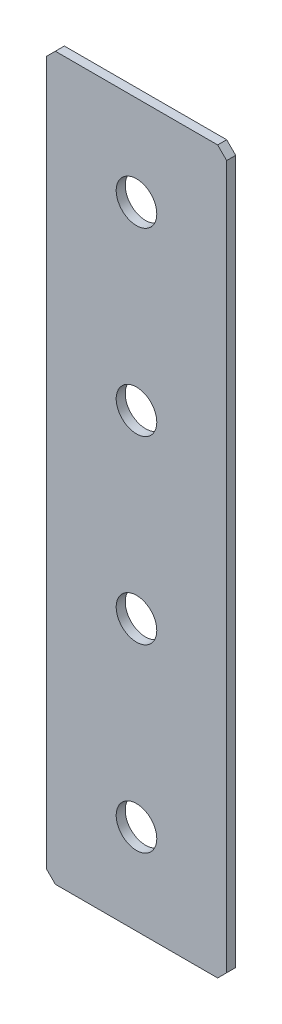
ISO-10303-21;
HEADER;
FILE_DESCRIPTION(('STEP AP214'),'2;1');
FILE_NAME('part.step','',(''),(''),'','','');
FILE_SCHEMA(('AUTOMOTIVE_DESIGN { 1 0 10303 214 1 1 1 1 }'));
ENDSEC;
DATA;
#1=APPLICATION_CONTEXT('core data for automotive mechanical design processes');
#2=APPLICATION_PROTOCOL_DEFINITION('international standard','automotive_design',2000,#1);
#3=PRODUCT_CONTEXT('',#1,'mechanical');
#4=PRODUCT('Part','Part','',(#3));
#5=PRODUCT_RELATED_PRODUCT_CATEGORY('part','',(#4));
#6=PRODUCT_DEFINITION_FORMATION('','',#4);
#7=PRODUCT_DEFINITION_CONTEXT('part definition',#1,'design');
#8=PRODUCT_DEFINITION('design','',#6,#7);
#9=PRODUCT_DEFINITION_SHAPE('','',#8);
#10=(LENGTH_UNIT() NAMED_UNIT(*) SI_UNIT(.MILLI.,.METRE.));
#11=(NAMED_UNIT(*) PLANE_ANGLE_UNIT() SI_UNIT($,.RADIAN.));
#12=(NAMED_UNIT(*) SI_UNIT($,.STERADIAN.) SOLID_ANGLE_UNIT());
#13=UNCERTAINTY_MEASURE_WITH_UNIT(LENGTH_MEASURE(1.E-05),#10,'distance_accuracy_value','');
#14=(GEOMETRIC_REPRESENTATION_CONTEXT(3) GLOBAL_UNCERTAINTY_ASSIGNED_CONTEXT((#13)) GLOBAL_UNIT_ASSIGNED_CONTEXT((#10,
#11,#12)) REPRESENTATION_CONTEXT('',''));
#15=CARTESIAN_POINT('',(0.,0.,0.));
#16=DIRECTION('',(0.,0.,1.));
#17=DIRECTION('',(1.,0.,0.));
#18=AXIS2_PLACEMENT_3D('',#15,#16,#17);
#19=CARTESIAN_POINT('',(20.,-80.,2.));
#20=DIRECTION('',(-1.,0.,0.));
#21=DIRECTION('',(0.,0.,1.));
#22=AXIS2_PLACEMENT_3D('',#19,#20,#21);
#23=PLANE('',#22);
#24=DIRECTION('',(0.,1.,0.));
#25=VECTOR('',#24,1.);
#26=CARTESIAN_POINT('',(20.,-80.,2.));
#27=LINE('',#26,#25);
#28=CARTESIAN_POINT('',(20.,-78.,2.));
#29=VERTEX_POINT('',#28);
#30=CARTESIAN_POINT('',(20.,78.,2.));
#31=VERTEX_POINT('',#30);
#32=EDGE_CURVE('E140',#29,#31,#27,.T.);
#33=ORIENTED_EDGE('',*,*,#32,.F.);
#34=DIRECTION('',(0.,0.,-1.));
#35=VECTOR('',#34,1.);
#36=CARTESIAN_POINT('',(20.,-78.,2.));
#37=LINE('',#36,#35);
#38=CARTESIAN_POINT('',(20.,-78.,0.));
#39=VERTEX_POINT('',#38);
#40=EDGE_CURVE('E181',#29,#39,#37,.T.);
#41=ORIENTED_EDGE('',*,*,#40,.T.);
#42=DIRECTION('',(0.,1.,0.));
#43=VECTOR('',#42,1.);
#44=CARTESIAN_POINT('',(20.,-80.,0.));
#45=LINE('',#44,#43);
#46=CARTESIAN_POINT('',(20.,78.,0.));
#47=VERTEX_POINT('',#46);
#48=EDGE_CURVE('E194',#39,#47,#45,.T.);
#49=ORIENTED_EDGE('',*,*,#48,.T.);
#50=DIRECTION('',(0.,0.,1.));
#51=VECTOR('',#50,1.);
#52=CARTESIAN_POINT('',(20.,78.,2.));
#53=LINE('',#52,#51);
#54=EDGE_CURVE('E178',#47,#31,#53,.T.);
#55=ORIENTED_EDGE('',*,*,#54,.T.);
#56=EDGE_LOOP('',(#33,#41,#49,#55));
#57=FACE_BOUND('',#56,.T.);
#58=ADVANCED_FACE('F45',(#57),#23,.F.);
#59=CARTESIAN_POINT('',(-20.,80.,2.));
#60=DIRECTION('',(0.,-1.,0.));
#61=DIRECTION('',(0.,0.,-1.));
#62=AXIS2_PLACEMENT_3D('',#59,#60,#61);
#63=PLANE('',#62);
#64=DIRECTION('',(-1.,0.,0.));
#65=VECTOR('',#64,1.);
#66=CARTESIAN_POINT('',(-20.,80.,0.));
#67=LINE('',#66,#65);
#68=CARTESIAN_POINT('',(18.,80.,0.));
#69=VERTEX_POINT('',#68);
#70=CARTESIAN_POINT('',(-18.,80.,0.));
#71=VERTEX_POINT('',#70);
#72=EDGE_CURVE('E149',#69,#71,#67,.T.);
#73=ORIENTED_EDGE('',*,*,#72,.T.);
#74=DIRECTION('',(0.,0.,1.));
#75=VECTOR('',#74,1.);
#76=CARTESIAN_POINT('',(-18.,80.,2.));
#77=LINE('',#76,#75);
#78=CARTESIAN_POINT('',(-18.,80.,2.));
#79=VERTEX_POINT('',#78);
#80=EDGE_CURVE('E11',#71,#79,#77,.T.);
#81=ORIENTED_EDGE('',*,*,#80,.T.);
#82=DIRECTION('',(-1.,0.,0.));
#83=VECTOR('',#82,1.);
#84=CARTESIAN_POINT('',(-20.,80.,2.));
#85=LINE('',#84,#83);
#86=CARTESIAN_POINT('',(18.,80.,2.));
#87=VERTEX_POINT('',#86);
#88=EDGE_CURVE('E147',#87,#79,#85,.T.);
#89=ORIENTED_EDGE('',*,*,#88,.F.);
#90=DIRECTION('',(0.,0.,-1.));
#91=VECTOR('',#90,1.);
#92=CARTESIAN_POINT('',(18.,80.,2.));
#93=LINE('',#92,#91);
#94=EDGE_CURVE('E54',#87,#69,#93,.T.);
#95=ORIENTED_EDGE('',*,*,#94,.T.);
#96=EDGE_LOOP('',(#73,#81,#89,#95));
#97=FACE_BOUND('',#96,.T.);
#98=ADVANCED_FACE('F190',(#97),#63,.F.);
#99=CARTESIAN_POINT('',(-20.,-80.,2.));
#100=DIRECTION('',(1.,0.,0.));
#101=DIRECTION('',(0.,0.,-1.));
#102=AXIS2_PLACEMENT_3D('',#99,#100,#101);
#103=PLANE('',#102);
#104=DIRECTION('',(0.,-1.,0.));
#105=VECTOR('',#104,1.);
#106=CARTESIAN_POINT('',(-20.,-80.,0.));
#107=LINE('',#106,#105);
#108=CARTESIAN_POINT('',(-20.,78.,0.));
#109=VERTEX_POINT('',#108);
#110=CARTESIAN_POINT('',(-20.,-78.,0.));
#111=VERTEX_POINT('',#110);
#112=EDGE_CURVE('E141',#109,#111,#107,.T.);
#113=ORIENTED_EDGE('',*,*,#112,.T.);
#114=DIRECTION('',(0.,0.,1.));
#115=VECTOR('',#114,1.);
#116=CARTESIAN_POINT('',(-20.,-78.,2.));
#117=LINE('',#116,#115);
#118=CARTESIAN_POINT('',(-20.,-78.,2.));
#119=VERTEX_POINT('',#118);
#120=EDGE_CURVE('E116',#111,#119,#117,.T.);
#121=ORIENTED_EDGE('',*,*,#120,.T.);
#122=DIRECTION('',(0.,-1.,0.));
#123=VECTOR('',#122,1.);
#124=CARTESIAN_POINT('',(-20.,-80.,2.));
#125=LINE('',#124,#123);
#126=CARTESIAN_POINT('',(-20.,78.,2.));
#127=VERTEX_POINT('',#126);
#128=EDGE_CURVE('E203',#127,#119,#125,.T.);
#129=ORIENTED_EDGE('',*,*,#128,.F.);
#130=DIRECTION('',(0.,0.,-1.));
#131=VECTOR('',#130,1.);
#132=CARTESIAN_POINT('',(-20.,78.,2.));
#133=LINE('',#132,#131);
#134=EDGE_CURVE('E122',#127,#109,#133,.T.);
#135=ORIENTED_EDGE('',*,*,#134,.T.);
#136=EDGE_LOOP('',(#113,#121,#129,#135));
#137=FACE_BOUND('',#136,.T.);
#138=ADVANCED_FACE('F258',(#137),#103,.F.);
#139=CARTESIAN_POINT('',(-20.,-80.,2.));
#140=DIRECTION('',(0.,1.,0.));
#141=DIRECTION('',(0.,0.,1.));
#142=AXIS2_PLACEMENT_3D('',#139,#140,#141);
#143=PLANE('',#142);
#144=DIRECTION('',(1.,0.,0.));
#145=VECTOR('',#144,1.);
#146=CARTESIAN_POINT('',(-20.,-80.,2.));
#147=LINE('',#146,#145);
#148=CARTESIAN_POINT('',(-18.,-80.,2.));
#149=VERTEX_POINT('',#148);
#150=CARTESIAN_POINT('',(18.,-80.,2.));
#151=VERTEX_POINT('',#150);
#152=EDGE_CURVE('E132',#149,#151,#147,.T.);
#153=ORIENTED_EDGE('',*,*,#152,.F.);
#154=DIRECTION('',(0.,0.,-1.));
#155=VECTOR('',#154,1.);
#156=CARTESIAN_POINT('',(-18.,-80.,2.));
#157=LINE('',#156,#155);
#158=CARTESIAN_POINT('',(-18.,-80.,0.));
#159=VERTEX_POINT('',#158);
#160=EDGE_CURVE('E115',#149,#159,#157,.T.);
#161=ORIENTED_EDGE('',*,*,#160,.T.);
#162=DIRECTION('',(1.,0.,0.));
#163=VECTOR('',#162,1.);
#164=CARTESIAN_POINT('',(-20.,-80.,0.));
#165=LINE('',#164,#163);
#166=CARTESIAN_POINT('',(18.,-80.,0.));
#167=VERTEX_POINT('',#166);
#168=EDGE_CURVE('E129',#159,#167,#165,.T.);
#169=ORIENTED_EDGE('',*,*,#168,.T.);
#170=DIRECTION('',(0.,0.,1.));
#171=VECTOR('',#170,1.);
#172=CARTESIAN_POINT('',(18.,-80.,2.));
#173=LINE('',#172,#171);
#174=EDGE_CURVE('E135',#167,#151,#173,.T.);
#175=ORIENTED_EDGE('',*,*,#174,.T.);
#176=EDGE_LOOP('',(#153,#161,#169,#175));
#177=FACE_BOUND('',#176,.T.);
#178=ADVANCED_FACE('F128',(#177),#143,.F.);
#179=CARTESIAN_POINT('',(0.,0.,2.));
#180=DIRECTION('',(0.,0.,-1.));
#181=DIRECTION('',(-1.,0.,0.));
#182=AXIS2_PLACEMENT_3D('',#179,#180,#181);
#183=PLANE('',#182);
#184=CARTESIAN_POINT('',(0.,60.,2.));
#185=DIRECTION('',(0.,0.,1.));
#186=DIRECTION('',(1.,0.,0.));
#187=AXIS2_PLACEMENT_3D('',#184,#185,#186);
#188=CIRCLE('',#187,4.5);
#189=CARTESIAN_POINT('',(4.5,60.,2.));
#190=VERTEX_POINT('',#189);
#191=EDGE_CURVE('E236',#190,#190,#188,.T.);
#192=ORIENTED_EDGE('',*,*,#191,.F.);
#193=EDGE_LOOP('',(#192));
#194=FACE_BOUND('',#193,.T.);
#195=CARTESIAN_POINT('',(0.,20.,2.));
#196=DIRECTION('',(0.,0.,1.));
#197=DIRECTION('',(1.,0.,0.));
#198=AXIS2_PLACEMENT_3D('',#195,#196,#197);
#199=CIRCLE('',#198,4.5);
#200=CARTESIAN_POINT('',(4.50000000000001,20.,2.));
#201=VERTEX_POINT('',#200);
#202=EDGE_CURVE('E228',#201,#201,#199,.T.);
#203=ORIENTED_EDGE('',*,*,#202,.F.);
#204=EDGE_LOOP('',(#203));
#205=FACE_BOUND('',#204,.T.);
#206=CARTESIAN_POINT('',(0.,-20.,2.));
#207=DIRECTION('',(0.,0.,1.));
#208=DIRECTION('',(1.,0.,0.));
#209=AXIS2_PLACEMENT_3D('',#206,#207,#208);
#210=CIRCLE('',#209,4.5);
#211=CARTESIAN_POINT('',(4.50000000000001,-20.,2.));
#212=VERTEX_POINT('',#211);
#213=EDGE_CURVE('E220',#212,#212,#210,.T.);
#214=ORIENTED_EDGE('',*,*,#213,.F.);
#215=EDGE_LOOP('',(#214));
#216=FACE_BOUND('',#215,.T.);
#217=CARTESIAN_POINT('',(0.,-60.,2.));
#218=DIRECTION('',(0.,0.,1.));
#219=DIRECTION('',(1.,0.,0.));
#220=AXIS2_PLACEMENT_3D('',#217,#218,#219);
#221=CIRCLE('',#220,4.5);
#222=CARTESIAN_POINT('',(4.50000000000002,-60.,2.));
#223=VERTEX_POINT('',#222);
#224=EDGE_CURVE('E212',#223,#223,#221,.T.);
#225=ORIENTED_EDGE('',*,*,#224,.F.);
#226=EDGE_LOOP('',(#225));
#227=FACE_BOUND('',#226,.T.);
#228=ORIENTED_EDGE('',*,*,#128,.T.);
#229=DIRECTION('',(-0.707106781186545,0.70710678118655,0.));
#230=VECTOR('',#229,1.);
#231=CARTESIAN_POINT('',(-18.,-80.,2.));
#232=LINE('',#231,#230);
#233=EDGE_CURVE('E175',#119,#149,#232,.F.);
#234=ORIENTED_EDGE('',*,*,#233,.T.);
#235=ORIENTED_EDGE('',*,*,#152,.T.);
#236=DIRECTION('',(-0.70710678118655,-0.707106781186545,0.));
#237=VECTOR('',#236,1.);
#238=CARTESIAN_POINT('',(20.,-78.,2.));
#239=LINE('',#238,#237);
#240=EDGE_CURVE('E172',#151,#29,#239,.F.);
#241=ORIENTED_EDGE('',*,*,#240,.T.);
#242=ORIENTED_EDGE('',*,*,#32,.T.);
#243=DIRECTION('',(0.707106781186545,-0.70710678118655,0.));
#244=VECTOR('',#243,1.);
#245=CARTESIAN_POINT('',(18.,80.,2.));
#246=LINE('',#245,#244);
#247=EDGE_CURVE('E66',#31,#87,#246,.F.);
#248=ORIENTED_EDGE('',*,*,#247,.T.);
#249=ORIENTED_EDGE('',*,*,#88,.T.);
#250=DIRECTION('',(0.70710678118655,0.707106781186545,0.));
#251=VECTOR('',#250,1.);
#252=CARTESIAN_POINT('',(-20.,78.,2.));
#253=LINE('',#252,#251);
#254=EDGE_CURVE('E169',#79,#127,#253,.F.);
#255=ORIENTED_EDGE('',*,*,#254,.T.);
#256=EDGE_LOOP('',(#228,#234,#235,#241,#242,#248,#249,#255));
#257=FACE_BOUND('',#256,.T.);
#258=ADVANCED_FACE('F245',(#194,#205,#216,#227,#257),#183,.F.);
#259=CARTESIAN_POINT('',(0.,0.,0.));
#260=DIRECTION('',(0.,0.,-1.));
#261=DIRECTION('',(-1.,0.,0.));
#262=AXIS2_PLACEMENT_3D('',#259,#260,#261);
#263=PLANE('',#262);
#264=CARTESIAN_POINT('',(0.,60.,0.));
#265=DIRECTION('',(0.,0.,1.));
#266=DIRECTION('',(1.,0.,0.));
#267=AXIS2_PLACEMENT_3D('',#264,#265,#266);
#268=CIRCLE('',#267,4.5);
#269=CARTESIAN_POINT('',(4.5,60.,0.));
#270=VERTEX_POINT('',#269);
#271=EDGE_CURVE('E232',#270,#270,#268,.T.);
#272=ORIENTED_EDGE('',*,*,#271,.T.);
#273=EDGE_LOOP('',(#272));
#274=FACE_BOUND('',#273,.T.);
#275=CARTESIAN_POINT('',(0.,20.,0.));
#276=DIRECTION('',(0.,0.,1.));
#277=DIRECTION('',(1.,0.,0.));
#278=AXIS2_PLACEMENT_3D('',#275,#276,#277);
#279=CIRCLE('',#278,4.5);
#280=CARTESIAN_POINT('',(4.50000000000001,20.,0.));
#281=VERTEX_POINT('',#280);
#282=EDGE_CURVE('E224',#281,#281,#279,.T.);
#283=ORIENTED_EDGE('',*,*,#282,.T.);
#284=EDGE_LOOP('',(#283));
#285=FACE_BOUND('',#284,.T.);
#286=CARTESIAN_POINT('',(0.,-20.,0.));
#287=DIRECTION('',(0.,0.,1.));
#288=DIRECTION('',(1.,0.,0.));
#289=AXIS2_PLACEMENT_3D('',#286,#287,#288);
#290=CIRCLE('',#289,4.5);
#291=CARTESIAN_POINT('',(4.50000000000001,-20.,0.));
#292=VERTEX_POINT('',#291);
#293=EDGE_CURVE('E216',#292,#292,#290,.T.);
#294=ORIENTED_EDGE('',*,*,#293,.T.);
#295=EDGE_LOOP('',(#294));
#296=FACE_BOUND('',#295,.T.);
#297=CARTESIAN_POINT('',(0.,-60.,0.));
#298=DIRECTION('',(0.,0.,1.));
#299=DIRECTION('',(1.,0.,0.));
#300=AXIS2_PLACEMENT_3D('',#297,#298,#299);
#301=CIRCLE('',#300,4.5);
#302=CARTESIAN_POINT('',(4.50000000000002,-60.,0.));
#303=VERTEX_POINT('',#302);
#304=EDGE_CURVE('E198',#303,#303,#301,.T.);
#305=ORIENTED_EDGE('',*,*,#304,.T.);
#306=EDGE_LOOP('',(#305));
#307=FACE_BOUND('',#306,.T.);
#308=ORIENTED_EDGE('',*,*,#168,.F.);
#309=DIRECTION('',(0.707106781186545,-0.70710678118655,0.));
#310=VECTOR('',#309,1.);
#311=CARTESIAN_POINT('',(-49.,-48.9999999999997,0.));
#312=LINE('',#311,#310);
#313=EDGE_CURVE('E111',#159,#111,#312,.F.);
#314=ORIENTED_EDGE('',*,*,#313,.T.);
#315=ORIENTED_EDGE('',*,*,#112,.F.);
#316=DIRECTION('',(-0.70710678118655,-0.707106781186545,0.));
#317=VECTOR('',#316,1.);
#318=CARTESIAN_POINT('',(-48.9999999999999,49.0000000000003,0.));
#319=LINE('',#318,#317);
#320=EDGE_CURVE('E157',#109,#71,#319,.F.);
#321=ORIENTED_EDGE('',*,*,#320,.T.);
#322=ORIENTED_EDGE('',*,*,#72,.F.);
#323=DIRECTION('',(-0.707106781186545,0.70710678118655,0.));
#324=VECTOR('',#323,1.);
#325=CARTESIAN_POINT('',(49.0000000000001,48.9999999999997,0.));
#326=LINE('',#325,#324);
#327=EDGE_CURVE('E134',#69,#47,#326,.F.);
#328=ORIENTED_EDGE('',*,*,#327,.T.);
#329=ORIENTED_EDGE('',*,*,#48,.F.);
#330=DIRECTION('',(0.70710678118655,0.707106781186545,0.));
#331=VECTOR('',#330,1.);
#332=CARTESIAN_POINT('',(48.9999999999999,-49.0000000000003,0.));
#333=LINE('',#332,#331);
#334=EDGE_CURVE('E123',#39,#167,#333,.F.);
#335=ORIENTED_EDGE('',*,*,#334,.T.);
#336=EDGE_LOOP('',(#308,#314,#315,#321,#322,#328,#329,#335));
#337=FACE_BOUND('',#336,.T.);
#338=ADVANCED_FACE('F137',(#274,#285,#296,#307,#337),#263,.T.);
#339=CARTESIAN_POINT('',(-18.,-80.,2.));
#340=DIRECTION('',(0.70710678118655,0.707106781186545,0.));
#341=DIRECTION('',(0.,0.,-1.));
#342=AXIS2_PLACEMENT_3D('',#339,#340,#341);
#343=PLANE('',#342);
#344=ORIENTED_EDGE('',*,*,#233,.F.);
#345=ORIENTED_EDGE('',*,*,#120,.F.);
#346=ORIENTED_EDGE('',*,*,#313,.F.);
#347=ORIENTED_EDGE('',*,*,#160,.F.);
#348=EDGE_LOOP('',(#344,#345,#346,#347));
#349=FACE_BOUND('',#348,.T.);
#350=ADVANCED_FACE('F114',(#349),#343,.F.);
#351=CARTESIAN_POINT('',(20.,-78.,2.));
#352=DIRECTION('',(-0.707106781186545,0.70710678118655,0.));
#353=DIRECTION('',(0.,0.,-1.));
#354=AXIS2_PLACEMENT_3D('',#351,#352,#353);
#355=PLANE('',#354);
#356=ORIENTED_EDGE('',*,*,#240,.F.);
#357=ORIENTED_EDGE('',*,*,#174,.F.);
#358=ORIENTED_EDGE('',*,*,#334,.F.);
#359=ORIENTED_EDGE('',*,*,#40,.F.);
#360=EDGE_LOOP('',(#356,#357,#358,#359));
#361=FACE_BOUND('',#360,.T.);
#362=ADVANCED_FACE('F262',(#361),#355,.F.);
#363=CARTESIAN_POINT('',(-20.,78.,2.));
#364=DIRECTION('',(0.707106781186545,-0.70710678118655,0.));
#365=DIRECTION('',(0.,0.,-1.));
#366=AXIS2_PLACEMENT_3D('',#363,#364,#365);
#367=PLANE('',#366);
#368=ORIENTED_EDGE('',*,*,#254,.F.);
#369=ORIENTED_EDGE('',*,*,#80,.F.);
#370=ORIENTED_EDGE('',*,*,#320,.F.);
#371=ORIENTED_EDGE('',*,*,#134,.F.);
#372=EDGE_LOOP('',(#368,#369,#370,#371));
#373=FACE_BOUND('',#372,.T.);
#374=ADVANCED_FACE('F260',(#373),#367,.F.);
#375=CARTESIAN_POINT('',(18.,80.,2.));
#376=DIRECTION('',(-0.70710678118655,-0.707106781186545,0.));
#377=DIRECTION('',(0.,0.,-1.));
#378=AXIS2_PLACEMENT_3D('',#375,#376,#377);
#379=PLANE('',#378);
#380=ORIENTED_EDGE('',*,*,#247,.F.);
#381=ORIENTED_EDGE('',*,*,#54,.F.);
#382=ORIENTED_EDGE('',*,*,#327,.F.);
#383=ORIENTED_EDGE('',*,*,#94,.F.);
#384=EDGE_LOOP('',(#380,#381,#382,#383));
#385=FACE_BOUND('',#384,.T.);
#386=ADVANCED_FACE('F47',(#385),#379,.F.);
#387=CARTESIAN_POINT('',(0.,-60.,2.));
#388=DIRECTION('',(0.,0.,1.));
#389=DIRECTION('',(1.,0.,0.));
#390=AXIS2_PLACEMENT_3D('',#387,#388,#389);
#391=CYLINDRICAL_SURFACE('',#390,4.5);
#392=ORIENTED_EDGE('',*,*,#304,.F.);
#393=EDGE_LOOP('',(#392));
#394=FACE_BOUND('',#393,.T.);
#395=ORIENTED_EDGE('',*,*,#224,.T.);
#396=EDGE_LOOP('',(#395));
#397=FACE_BOUND('',#396,.T.);
#398=ADVANCED_FACE('F267',(#394,#397),#391,.F.);
#399=CARTESIAN_POINT('',(0.,-20.,2.));
#400=DIRECTION('',(0.,0.,1.));
#401=DIRECTION('',(1.,0.,0.));
#402=AXIS2_PLACEMENT_3D('',#399,#400,#401);
#403=CYLINDRICAL_SURFACE('',#402,4.5);
#404=ORIENTED_EDGE('',*,*,#293,.F.);
#405=EDGE_LOOP('',(#404));
#406=FACE_BOUND('',#405,.T.);
#407=ORIENTED_EDGE('',*,*,#213,.T.);
#408=EDGE_LOOP('',(#407));
#409=FACE_BOUND('',#408,.T.);
#410=ADVANCED_FACE('F332',(#406,#409),#403,.F.);
#411=CARTESIAN_POINT('',(0.,20.,2.));
#412=DIRECTION('',(0.,0.,1.));
#413=DIRECTION('',(1.,0.,0.));
#414=AXIS2_PLACEMENT_3D('',#411,#412,#413);
#415=CYLINDRICAL_SURFACE('',#414,4.5);
#416=ORIENTED_EDGE('',*,*,#282,.F.);
#417=EDGE_LOOP('',(#416));
#418=FACE_BOUND('',#417,.T.);
#419=ORIENTED_EDGE('',*,*,#202,.T.);
#420=EDGE_LOOP('',(#419));
#421=FACE_BOUND('',#420,.T.);
#422=ADVANCED_FACE('F340',(#418,#421),#415,.F.);
#423=CARTESIAN_POINT('',(0.,60.,2.));
#424=DIRECTION('',(0.,0.,1.));
#425=DIRECTION('',(1.,0.,0.));
#426=AXIS2_PLACEMENT_3D('',#423,#424,#425);
#427=CYLINDRICAL_SURFACE('',#426,4.5);
#428=ORIENTED_EDGE('',*,*,#271,.F.);
#429=EDGE_LOOP('',(#428));
#430=FACE_BOUND('',#429,.T.);
#431=ORIENTED_EDGE('',*,*,#191,.T.);
#432=EDGE_LOOP('',(#431));
#433=FACE_BOUND('',#432,.T.);
#434=ADVANCED_FACE('F243',(#430,#433),#427,.F.);
#435=CLOSED_SHELL('',(#58,#98,#138,#178,#258,#338,#350,#362,#374,#386,#398,#410,#422,#434));
#436=MANIFOLD_SOLID_BREP('B2',#435);
#437=ADVANCED_BREP_SHAPE_REPRESENTATION('',(#18,#436),#14);
#438=SHAPE_DEFINITION_REPRESENTATION(#9,#437);
ENDSEC;
END-ISO-10303-21;
